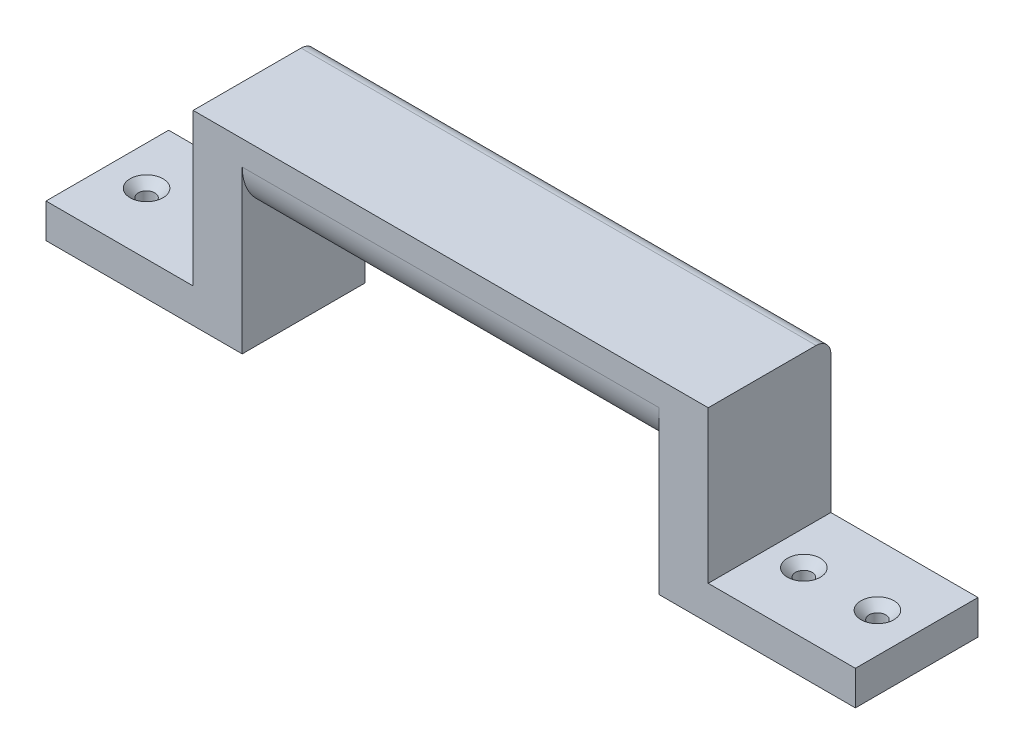
ISO-10303-21;
HEADER;
FILE_DESCRIPTION(('STEP AP214'),'2;1');
FILE_NAME('part.step','',(''),(''),'','','');
FILE_SCHEMA(('AUTOMOTIVE_DESIGN { 1 0 10303 214 1 1 1 1 }'));
ENDSEC;
DATA;
#1=APPLICATION_CONTEXT('core data for automotive mechanical design processes');
#2=APPLICATION_PROTOCOL_DEFINITION('international standard','automotive_design',2000,#1);
#3=PRODUCT_CONTEXT('',#1,'mechanical');
#4=PRODUCT('Part','Part','',(#3));
#5=PRODUCT_RELATED_PRODUCT_CATEGORY('part','',(#4));
#6=PRODUCT_DEFINITION_FORMATION('','',#4);
#7=PRODUCT_DEFINITION_CONTEXT('part definition',#1,'design');
#8=PRODUCT_DEFINITION('design','',#6,#7);
#9=PRODUCT_DEFINITION_SHAPE('','',#8);
#10=(LENGTH_UNIT() NAMED_UNIT(*) SI_UNIT(.MILLI.,.METRE.));
#11=(NAMED_UNIT(*) PLANE_ANGLE_UNIT() SI_UNIT($,.RADIAN.));
#12=(NAMED_UNIT(*) SI_UNIT($,.STERADIAN.) SOLID_ANGLE_UNIT());
#13=UNCERTAINTY_MEASURE_WITH_UNIT(LENGTH_MEASURE(1.E-05),#10,'distance_accuracy_value','');
#14=(GEOMETRIC_REPRESENTATION_CONTEXT(3) GLOBAL_UNCERTAINTY_ASSIGNED_CONTEXT((#13)) GLOBAL_UNIT_ASSIGNED_CONTEXT((#10,
#11,#12)) REPRESENTATION_CONTEXT('',''));
#15=CARTESIAN_POINT('',(0.,0.,0.));
#16=DIRECTION('',(0.,0.,1.));
#17=DIRECTION('',(1.,0.,0.));
#18=AXIS2_PLACEMENT_3D('',#15,#16,#17);
#19=CARTESIAN_POINT('',(-96.5218952923804,1.35730050933787,25.));
#20=DIRECTION('',(-1.,0.,0.));
#21=DIRECTION('',(0.,0.,1.));
#22=AXIS2_PLACEMENT_3D('',#19,#20,#21);
#23=PLANE('',#22);
#24=DIRECTION('',(0.,1.,0.));
#25=VECTOR('',#24,1.);
#26=CARTESIAN_POINT('',(-96.5218952923804,1.35730050933787,25.));
#27=LINE('',#26,#25);
#28=CARTESIAN_POINT('',(-96.5218952923804,-21.6426994906621,25.));
#29=VERTEX_POINT('',#28);
#30=CARTESIAN_POINT('',(-96.5218952923804,11.3573005093379,25.));
#31=VERTEX_POINT('',#30);
#32=EDGE_CURVE('E178',#29,#31,#27,.T.);
#33=ORIENTED_EDGE('',*,*,#32,.F.);
#34=DIRECTION('',(0.,0.,1.));
#35=VECTOR('',#34,1.);
#36=CARTESIAN_POINT('',(-96.5218952923804,-21.6426994906621,0.));
#37=LINE('',#36,#35);
#38=CARTESIAN_POINT('',(-96.5218952923804,-21.6426994906621,0.));
#39=VERTEX_POINT('',#38);
#40=EDGE_CURVE('E237',#39,#29,#37,.T.);
#41=ORIENTED_EDGE('',*,*,#40,.F.);
#42=DIRECTION('',(0.,1.,0.));
#43=VECTOR('',#42,1.);
#44=CARTESIAN_POINT('',(-96.5218952923804,1.35730050933787,0.));
#45=LINE('',#44,#43);
#46=CARTESIAN_POINT('',(-96.5218952923804,11.3573005093379,0.));
#47=VERTEX_POINT('',#46);
#48=EDGE_CURVE('E165',#39,#47,#45,.T.);
#49=ORIENTED_EDGE('',*,*,#48,.T.);
#50=CARTESIAN_POINT('',(-96.5218952923804,11.3573005093379,10.));
#51=DIRECTION('',(-1.,0.,0.));
#52=DIRECTION('',(0.,0.,1.));
#53=AXIS2_PLACEMENT_3D('',#50,#51,#52);
#54=CIRCLE('',#53,10.);
#55=CARTESIAN_POINT('',(-96.5218952923804,1.35730050933787,10.));
#56=VERTEX_POINT('',#55);
#57=EDGE_CURVE('E217',#47,#56,#54,.T.);
#58=ORIENTED_EDGE('',*,*,#57,.T.);
#59=DIRECTION('',(0.,0.,-1.));
#60=VECTOR('',#59,1.);
#61=CARTESIAN_POINT('',(-96.5218952923804,1.35730050933787,25.));
#62=LINE('',#61,#60);
#63=CARTESIAN_POINT('',(-96.5218952923804,1.35730050933787,15.));
#64=VERTEX_POINT('',#63);
#65=EDGE_CURVE('E200',#64,#56,#62,.T.);
#66=ORIENTED_EDGE('',*,*,#65,.F.);
#67=CARTESIAN_POINT('',(-96.5218952923804,11.3573005093379,15.));
#68=DIRECTION('',(-1.,0.,0.));
#69=DIRECTION('',(0.,0.,1.));
#70=AXIS2_PLACEMENT_3D('',#67,#68,#69);
#71=CIRCLE('',#70,10.);
#72=EDGE_CURVE('E221',#64,#31,#71,.T.);
#73=ORIENTED_EDGE('',*,*,#72,.T.);
#74=EDGE_LOOP('',(#33,#41,#49,#58,#66,#73));
#75=FACE_BOUND('',#74,.T.);
#76=ADVANCED_FACE('F33',(#75),#23,.F.);
#77=CARTESIAN_POINT('',(-11.5218952923804,1.35730050933787,25.));
#78=DIRECTION('',(0.,1.,0.));
#79=DIRECTION('',(0.,0.,1.));
#80=AXIS2_PLACEMENT_3D('',#77,#78,#79);
#81=PLANE('',#80);
#82=ORIENTED_EDGE('',*,*,#65,.T.);
#83=DIRECTION('',(1.,0.,0.));
#84=VECTOR('',#83,1.);
#85=CARTESIAN_POINT('',(-11.5218952923804,1.35730050933787,10.));
#86=LINE('',#85,#84);
#87=CARTESIAN_POINT('',(-11.5218952923804,1.35730050933787,10.));
#88=VERTEX_POINT('',#87);
#89=EDGE_CURVE('E205',#56,#88,#86,.T.);
#90=ORIENTED_EDGE('',*,*,#89,.T.);
#91=DIRECTION('',(0.,0.,-1.));
#92=VECTOR('',#91,1.);
#93=CARTESIAN_POINT('',(-11.5218952923804,1.35730050933787,25.));
#94=LINE('',#93,#92);
#95=CARTESIAN_POINT('',(-11.5218952923804,1.35730050933787,15.));
#96=VERTEX_POINT('',#95);
#97=EDGE_CURVE('E197',#96,#88,#94,.T.);
#98=ORIENTED_EDGE('',*,*,#97,.F.);
#99=DIRECTION('',(1.,0.,0.));
#100=VECTOR('',#99,1.);
#101=CARTESIAN_POINT('',(-11.5218952923804,1.35730050933787,15.));
#102=LINE('',#101,#100);
#103=EDGE_CURVE('E203',#96,#64,#102,.F.);
#104=ORIENTED_EDGE('',*,*,#103,.T.);
#105=EDGE_LOOP('',(#82,#90,#98,#104));
#106=FACE_BOUND('',#105,.T.);
#107=ADVANCED_FACE('F298',(#106),#81,.F.);
#108=CARTESIAN_POINT('',(-11.5218952923804,-23.6426994906621,25.));
#109=DIRECTION('',(1.,0.,0.));
#110=DIRECTION('',(0.,0.,-1.));
#111=AXIS2_PLACEMENT_3D('',#108,#109,#110);
#112=PLANE('',#111);
#113=DIRECTION('',(0.,-1.,0.));
#114=VECTOR('',#113,1.);
#115=CARTESIAN_POINT('',(-11.5218952923804,-23.6426994906621,0.));
#116=LINE('',#115,#114);
#117=CARTESIAN_POINT('',(-11.5218952923804,11.3573005093379,0.));
#118=VERTEX_POINT('',#117);
#119=CARTESIAN_POINT('',(-11.5218952923804,-21.6426994906621,0.));
#120=VERTEX_POINT('',#119);
#121=EDGE_CURVE('E161',#118,#120,#116,.T.);
#122=ORIENTED_EDGE('',*,*,#121,.T.);
#123=DIRECTION('',(0.,0.,1.));
#124=VECTOR('',#123,1.);
#125=CARTESIAN_POINT('',(-11.5218952923804,-21.6426994906621,0.));
#126=LINE('',#125,#124);
#127=CARTESIAN_POINT('',(-11.5218952923804,-21.6426994906621,25.));
#128=VERTEX_POINT('',#127);
#129=EDGE_CURVE('E50',#120,#128,#126,.T.);
#130=ORIENTED_EDGE('',*,*,#129,.T.);
#131=DIRECTION('',(0.,-1.,0.));
#132=VECTOR('',#131,1.);
#133=CARTESIAN_POINT('',(-11.5218952923804,-23.6426994906621,25.));
#134=LINE('',#133,#132);
#135=CARTESIAN_POINT('',(-11.5218952923804,11.3573005093379,25.));
#136=VERTEX_POINT('',#135);
#137=EDGE_CURVE('E272',#136,#128,#134,.T.);
#138=ORIENTED_EDGE('',*,*,#137,.F.);
#139=CARTESIAN_POINT('',(-11.5218952923804,11.3573005093379,15.));
#140=DIRECTION('',(1.,0.,0.));
#141=DIRECTION('',(0.,0.,-1.));
#142=AXIS2_PLACEMENT_3D('',#139,#140,#141);
#143=CIRCLE('',#142,10.);
#144=EDGE_CURVE('E219',#136,#96,#143,.T.);
#145=ORIENTED_EDGE('',*,*,#144,.T.);
#146=ORIENTED_EDGE('',*,*,#97,.T.);
#147=CARTESIAN_POINT('',(-11.5218952923804,11.3573005093379,10.));
#148=DIRECTION('',(1.,0.,0.));
#149=DIRECTION('',(0.,0.,-1.));
#150=AXIS2_PLACEMENT_3D('',#147,#148,#149);
#151=CIRCLE('',#150,10.);
#152=EDGE_CURVE('E214',#88,#118,#151,.T.);
#153=ORIENTED_EDGE('',*,*,#152,.T.);
#154=EDGE_LOOP('',(#122,#130,#138,#145,#146,#153));
#155=FACE_BOUND('',#154,.T.);
#156=ADVANCED_FACE('F301',(#155),#112,.F.);
#157=CARTESIAN_POINT('',(28.4781047076196,-14.6426994906621,25.));
#158=DIRECTION('',(-1.,0.,0.));
#159=DIRECTION('',(0.,0.,1.));
#160=AXIS2_PLACEMENT_3D('',#157,#158,#159);
#161=PLANE('',#160);
#162=DIRECTION('',(0.,1.,0.));
#163=VECTOR('',#162,1.);
#164=CARTESIAN_POINT('',(28.4781047076196,-14.6426994906621,25.));
#165=LINE('',#164,#163);
#166=CARTESIAN_POINT('',(28.4781047076196,-21.6426994906621,25.));
#167=VERTEX_POINT('',#166);
#168=CARTESIAN_POINT('',(28.4781047076196,-14.6426994906621,25.));
#169=VERTEX_POINT('',#168);
#170=EDGE_CURVE('E155',#167,#169,#165,.T.);
#171=ORIENTED_EDGE('',*,*,#170,.F.);
#172=DIRECTION('',(0.,0.,1.));
#173=VECTOR('',#172,1.);
#174=CARTESIAN_POINT('',(28.4781047076196,-21.6426994906621,0.));
#175=LINE('',#174,#173);
#176=CARTESIAN_POINT('',(28.4781047076196,-21.6426994906621,0.));
#177=VERTEX_POINT('',#176);
#178=EDGE_CURVE('E142',#177,#167,#175,.T.);
#179=ORIENTED_EDGE('',*,*,#178,.F.);
#180=DIRECTION('',(0.,1.,0.));
#181=VECTOR('',#180,1.);
#182=CARTESIAN_POINT('',(28.4781047076196,-14.6426994906621,0.));
#183=LINE('',#182,#181);
#184=CARTESIAN_POINT('',(28.4781047076196,-14.6426994906621,0.));
#185=VERTEX_POINT('',#184);
#186=EDGE_CURVE('E153',#177,#185,#183,.T.);
#187=ORIENTED_EDGE('',*,*,#186,.T.);
#188=DIRECTION('',(0.,0.,-1.));
#189=VECTOR('',#188,1.);
#190=CARTESIAN_POINT('',(28.4781047076196,-14.6426994906621,25.));
#191=LINE('',#190,#189);
#192=EDGE_CURVE('E195',#169,#185,#191,.T.);
#193=ORIENTED_EDGE('',*,*,#192,.F.);
#194=EDGE_LOOP('',(#171,#179,#187,#193));
#195=FACE_BOUND('',#194,.T.);
#196=ADVANCED_FACE('F151',(#195),#161,.F.);
#197=CARTESIAN_POINT('',(-1.52189529238038,-14.6426994906621,25.));
#198=DIRECTION('',(0.,-1.,0.));
#199=DIRECTION('',(0.,0.,-1.));
#200=AXIS2_PLACEMENT_3D('',#197,#198,#199);
#201=PLANE('',#200);
#202=CARTESIAN_POINT('',(20.4781047076196,-14.6426994906621,12.5));
#203=DIRECTION('',(0.,1.,0.));
#204=DIRECTION('',(0.,0.,1.));
#205=AXIS2_PLACEMENT_3D('',#202,#203,#204);
#206=CIRCLE('',#205,3.36);
#207=CARTESIAN_POINT('',(20.4781047076196,-14.6426994906621,15.86));
#208=VERTEX_POINT('',#207);
#209=EDGE_CURVE('E259',#208,#208,#206,.T.);
#210=ORIENTED_EDGE('',*,*,#209,.F.);
#211=EDGE_LOOP('',(#210));
#212=FACE_BOUND('',#211,.T.);
#213=CARTESIAN_POINT('',(5.47810470761964,-14.6426994906621,12.5));
#214=DIRECTION('',(0.,1.,0.));
#215=DIRECTION('',(0.,0.,1.));
#216=AXIS2_PLACEMENT_3D('',#213,#214,#215);
#217=CIRCLE('',#216,3.36);
#218=CARTESIAN_POINT('',(5.47810470761964,-14.6426994906621,15.86));
#219=VERTEX_POINT('',#218);
#220=EDGE_CURVE('E265',#219,#219,#217,.T.);
#221=ORIENTED_EDGE('',*,*,#220,.F.);
#222=EDGE_LOOP('',(#221));
#223=FACE_BOUND('',#222,.T.);
#224=DIRECTION('',(-1.,0.,0.));
#225=VECTOR('',#224,1.);
#226=CARTESIAN_POINT('',(-1.52189529238038,-14.6426994906621,0.));
#227=LINE('',#226,#225);
#228=CARTESIAN_POINT('',(-1.52189529238038,-14.6426994906621,0.));
#229=VERTEX_POINT('',#228);
#230=EDGE_CURVE('E160',#185,#229,#227,.T.);
#231=ORIENTED_EDGE('',*,*,#230,.T.);
#232=DIRECTION('',(0.,0.,-1.));
#233=VECTOR('',#232,1.);
#234=CARTESIAN_POINT('',(-1.52189529238038,-14.6426994906621,25.));
#235=LINE('',#234,#233);
#236=CARTESIAN_POINT('',(-1.52189529238038,-14.6426994906621,25.));
#237=VERTEX_POINT('',#236);
#238=EDGE_CURVE('E192',#237,#229,#235,.T.);
#239=ORIENTED_EDGE('',*,*,#238,.F.);
#240=DIRECTION('',(-1.,0.,0.));
#241=VECTOR('',#240,1.);
#242=CARTESIAN_POINT('',(-1.52189529238038,-14.6426994906621,25.));
#243=LINE('',#242,#241);
#244=EDGE_CURVE('E276',#169,#237,#243,.T.);
#245=ORIENTED_EDGE('',*,*,#244,.F.);
#246=ORIENTED_EDGE('',*,*,#192,.T.);
#247=EDGE_LOOP('',(#231,#239,#245,#246));
#248=FACE_BOUND('',#247,.T.);
#249=ADVANCED_FACE('F321',(#212,#223,#248),#201,.F.);
#250=CARTESIAN_POINT('',(-1.52189529238038,16.3573005093379,25.));
#251=DIRECTION('',(-1.,0.,0.));
#252=DIRECTION('',(0.,0.,1.));
#253=AXIS2_PLACEMENT_3D('',#250,#251,#252);
#254=PLANE('',#253);
#255=DIRECTION('',(0.,1.,0.));
#256=VECTOR('',#255,1.);
#257=CARTESIAN_POINT('',(-1.52189529238038,16.3573005093379,0.));
#258=LINE('',#257,#256);
#259=CARTESIAN_POINT('',(-1.52189529238038,13.3573005093379,0.));
#260=VERTEX_POINT('',#259);
#261=EDGE_CURVE('E163',#229,#260,#258,.T.);
#262=ORIENTED_EDGE('',*,*,#261,.T.);
#263=CARTESIAN_POINT('',(-1.52189529238038,13.3573005093379,3.));
#264=DIRECTION('',(-1.,0.,0.));
#265=DIRECTION('',(0.,0.,1.));
#266=AXIS2_PLACEMENT_3D('',#263,#264,#265);
#267=CIRCLE('',#266,3.);
#268=CARTESIAN_POINT('',(-1.52189529238038,16.3573005093379,3.));
#269=VERTEX_POINT('',#268);
#270=EDGE_CURVE('E11',#260,#269,#267,.F.);
#271=ORIENTED_EDGE('',*,*,#270,.T.);
#272=DIRECTION('',(0.,0.,-1.));
#273=VECTOR('',#272,1.);
#274=CARTESIAN_POINT('',(-1.52189529238038,16.3573005093379,25.));
#275=LINE('',#274,#273);
#276=CARTESIAN_POINT('',(-1.52189529238038,16.3573005093379,25.));
#277=VERTEX_POINT('',#276);
#278=EDGE_CURVE('E189',#277,#269,#275,.T.);
#279=ORIENTED_EDGE('',*,*,#278,.F.);
#280=DIRECTION('',(0.,1.,0.));
#281=VECTOR('',#280,1.);
#282=CARTESIAN_POINT('',(-1.52189529238038,16.3573005093379,25.));
#283=LINE('',#282,#281);
#284=EDGE_CURVE('E278',#237,#277,#283,.T.);
#285=ORIENTED_EDGE('',*,*,#284,.F.);
#286=ORIENTED_EDGE('',*,*,#238,.T.);
#287=EDGE_LOOP('',(#262,#271,#279,#285,#286));
#288=FACE_BOUND('',#287,.T.);
#289=ADVANCED_FACE('F325',(#288),#254,.F.);
#290=CARTESIAN_POINT('',(-106.52189529238,16.3573005093379,25.));
#291=DIRECTION('',(0.,-1.,0.));
#292=DIRECTION('',(0.,0.,-1.));
#293=AXIS2_PLACEMENT_3D('',#290,#291,#292);
#294=PLANE('',#293);
#295=ORIENTED_EDGE('',*,*,#278,.T.);
#296=DIRECTION('',(-1.,0.,0.));
#297=VECTOR('',#296,1.);
#298=CARTESIAN_POINT('',(-106.52189529238,16.3573005093379,3.));
#299=LINE('',#298,#297);
#300=CARTESIAN_POINT('',(-106.52189529238,16.3573005093379,3.));
#301=VERTEX_POINT('',#300);
#302=EDGE_CURVE('E224',#269,#301,#299,.T.);
#303=ORIENTED_EDGE('',*,*,#302,.T.);
#304=DIRECTION('',(0.,0.,-1.));
#305=VECTOR('',#304,1.);
#306=CARTESIAN_POINT('',(-106.52189529238,16.3573005093379,25.));
#307=LINE('',#306,#305);
#308=CARTESIAN_POINT('',(-106.52189529238,16.3573005093379,25.));
#309=VERTEX_POINT('',#308);
#310=EDGE_CURVE('E186',#309,#301,#307,.T.);
#311=ORIENTED_EDGE('',*,*,#310,.F.);
#312=DIRECTION('',(-1.,0.,0.));
#313=VECTOR('',#312,1.);
#314=CARTESIAN_POINT('',(-106.52189529238,16.3573005093379,25.));
#315=LINE('',#314,#313);
#316=EDGE_CURVE('E280',#277,#309,#315,.T.);
#317=ORIENTED_EDGE('',*,*,#316,.F.);
#318=EDGE_LOOP('',(#295,#303,#311,#317));
#319=FACE_BOUND('',#318,.T.);
#320=ADVANCED_FACE('F331',(#319),#294,.F.);
#321=CARTESIAN_POINT('',(-106.52189529238,-14.6426994906621,25.));
#322=DIRECTION('',(1.,0.,0.));
#323=DIRECTION('',(0.,0.,-1.));
#324=AXIS2_PLACEMENT_3D('',#321,#322,#323);
#325=PLANE('',#324);
#326=ORIENTED_EDGE('',*,*,#310,.T.);
#327=CARTESIAN_POINT('',(-106.52189529238,13.3573005093379,3.));
#328=DIRECTION('',(1.,0.,0.));
#329=DIRECTION('',(0.,0.,-1.));
#330=AXIS2_PLACEMENT_3D('',#327,#328,#329);
#331=CIRCLE('',#330,3.);
#332=CARTESIAN_POINT('',(-106.52189529238,13.3573005093379,0.));
#333=VERTEX_POINT('',#332);
#334=EDGE_CURVE('E227',#301,#333,#331,.F.);
#335=ORIENTED_EDGE('',*,*,#334,.T.);
#336=DIRECTION('',(0.,-1.,0.));
#337=VECTOR('',#336,1.);
#338=CARTESIAN_POINT('',(-106.52189529238,-14.6426994906621,0.));
#339=LINE('',#338,#337);
#340=CARTESIAN_POINT('',(-106.52189529238,-14.6426994906621,0.));
#341=VERTEX_POINT('',#340);
#342=EDGE_CURVE('E171',#333,#341,#339,.T.);
#343=ORIENTED_EDGE('',*,*,#342,.T.);
#344=DIRECTION('',(0.,0.,-1.));
#345=VECTOR('',#344,1.);
#346=CARTESIAN_POINT('',(-106.52189529238,-14.6426994906621,25.));
#347=LINE('',#346,#345);
#348=CARTESIAN_POINT('',(-106.52189529238,-14.6426994906621,25.));
#349=VERTEX_POINT('',#348);
#350=EDGE_CURVE('E182',#349,#341,#347,.T.);
#351=ORIENTED_EDGE('',*,*,#350,.F.);
#352=DIRECTION('',(0.,-1.,0.));
#353=VECTOR('',#352,1.);
#354=CARTESIAN_POINT('',(-106.52189529238,-14.6426994906621,25.));
#355=LINE('',#354,#353);
#356=EDGE_CURVE('E282',#309,#349,#355,.T.);
#357=ORIENTED_EDGE('',*,*,#356,.F.);
#358=EDGE_LOOP('',(#326,#335,#343,#351,#357));
#359=FACE_BOUND('',#358,.T.);
#360=ADVANCED_FACE('F334',(#359),#325,.F.);
#361=CARTESIAN_POINT('',(-136.52189529238,-14.6426994906621,25.));
#362=DIRECTION('',(0.,-1.,0.));
#363=DIRECTION('',(0.,0.,-1.));
#364=AXIS2_PLACEMENT_3D('',#361,#362,#363);
#365=PLANE('',#364);
#366=CARTESIAN_POINT('',(-128.52189529238,-14.6426994906621,12.5));
#367=DIRECTION('',(0.,1.,0.));
#368=DIRECTION('',(0.,0.,1.));
#369=AXIS2_PLACEMENT_3D('',#366,#367,#368);
#370=CIRCLE('',#369,3.36);
#371=CARTESIAN_POINT('',(-128.52189529238,-14.6426994906621,15.86));
#372=VERTEX_POINT('',#371);
#373=EDGE_CURVE('E235',#372,#372,#370,.T.);
#374=ORIENTED_EDGE('',*,*,#373,.F.);
#375=EDGE_LOOP('',(#374));
#376=FACE_BOUND('',#375,.T.);
#377=CARTESIAN_POINT('',(-113.52189529238,-14.6426994906621,12.5));
#378=DIRECTION('',(0.,1.,0.));
#379=DIRECTION('',(0.,0.,1.));
#380=AXIS2_PLACEMENT_3D('',#377,#378,#379);
#381=CIRCLE('',#380,3.36);
#382=CARTESIAN_POINT('',(-113.52189529238,-14.6426994906621,15.86));
#383=VERTEX_POINT('',#382);
#384=EDGE_CURVE('E253',#383,#383,#381,.T.);
#385=ORIENTED_EDGE('',*,*,#384,.F.);
#386=EDGE_LOOP('',(#385));
#387=FACE_BOUND('',#386,.T.);
#388=DIRECTION('',(-1.,0.,0.));
#389=VECTOR('',#388,1.);
#390=CARTESIAN_POINT('',(-136.52189529238,-14.6426994906621,0.));
#391=LINE('',#390,#389);
#392=CARTESIAN_POINT('',(-136.52189529238,-14.6426994906621,0.));
#393=VERTEX_POINT('',#392);
#394=EDGE_CURVE('E173',#341,#393,#391,.T.);
#395=ORIENTED_EDGE('',*,*,#394,.T.);
#396=DIRECTION('',(0.,0.,-1.));
#397=VECTOR('',#396,1.);
#398=CARTESIAN_POINT('',(-136.52189529238,-14.6426994906621,25.));
#399=LINE('',#398,#397);
#400=CARTESIAN_POINT('',(-136.52189529238,-14.6426994906621,25.));
#401=VERTEX_POINT('',#400);
#402=EDGE_CURVE('E179',#401,#393,#399,.T.);
#403=ORIENTED_EDGE('',*,*,#402,.F.);
#404=DIRECTION('',(-1.,0.,0.));
#405=VECTOR('',#404,1.);
#406=CARTESIAN_POINT('',(-136.52189529238,-14.6426994906621,25.));
#407=LINE('',#406,#405);
#408=EDGE_CURVE('E284',#349,#401,#407,.T.);
#409=ORIENTED_EDGE('',*,*,#408,.F.);
#410=ORIENTED_EDGE('',*,*,#350,.T.);
#411=EDGE_LOOP('',(#395,#403,#409,#410));
#412=FACE_BOUND('',#411,.T.);
#413=ADVANCED_FACE('F340',(#376,#387,#412),#365,.F.);
#414=CARTESIAN_POINT('',(-136.52189529238,-23.6426994906621,25.));
#415=DIRECTION('',(1.,0.,0.));
#416=DIRECTION('',(0.,0.,-1.));
#417=AXIS2_PLACEMENT_3D('',#414,#415,#416);
#418=PLANE('',#417);
#419=DIRECTION('',(0.,-1.,0.));
#420=VECTOR('',#419,1.);
#421=CARTESIAN_POINT('',(-136.52189529238,-23.6426994906621,0.));
#422=LINE('',#421,#420);
#423=CARTESIAN_POINT('',(-136.52189529238,-21.6426994906621,0.));
#424=VERTEX_POINT('',#423);
#425=EDGE_CURVE('E175',#393,#424,#422,.T.);
#426=ORIENTED_EDGE('',*,*,#425,.T.);
#427=DIRECTION('',(0.,0.,1.));
#428=VECTOR('',#427,1.);
#429=CARTESIAN_POINT('',(-136.52189529238,-21.6426994906621,0.));
#430=LINE('',#429,#428);
#431=CARTESIAN_POINT('',(-136.52189529238,-21.6426994906621,25.));
#432=VERTEX_POINT('',#431);
#433=EDGE_CURVE('E58',#424,#432,#430,.T.);
#434=ORIENTED_EDGE('',*,*,#433,.T.);
#435=DIRECTION('',(0.,-1.,0.));
#436=VECTOR('',#435,1.);
#437=CARTESIAN_POINT('',(-136.52189529238,-23.6426994906621,25.));
#438=LINE('',#437,#436);
#439=EDGE_CURVE('E183',#401,#432,#438,.T.);
#440=ORIENTED_EDGE('',*,*,#439,.F.);
#441=ORIENTED_EDGE('',*,*,#402,.T.);
#442=EDGE_LOOP('',(#426,#434,#440,#441));
#443=FACE_BOUND('',#442,.T.);
#444=ADVANCED_FACE('F342',(#443),#418,.F.);
#445=CARTESIAN_POINT('',(0.,0.,25.));
#446=DIRECTION('',(0.,0.,-1.));
#447=DIRECTION('',(-1.,0.,0.));
#448=AXIS2_PLACEMENT_3D('',#445,#446,#447);
#449=PLANE('',#448);
#450=ORIENTED_EDGE('',*,*,#137,.T.);
#451=DIRECTION('',(-1.,0.,0.));
#452=VECTOR('',#451,1.);
#453=CARTESIAN_POINT('',(28.4781047076196,-21.6426994906621,25.));
#454=LINE('',#453,#452);
#455=EDGE_CURVE('E147',#167,#128,#454,.T.);
#456=ORIENTED_EDGE('',*,*,#455,.F.);
#457=ORIENTED_EDGE('',*,*,#170,.T.);
#458=ORIENTED_EDGE('',*,*,#244,.T.);
#459=ORIENTED_EDGE('',*,*,#284,.T.);
#460=ORIENTED_EDGE('',*,*,#316,.T.);
#461=ORIENTED_EDGE('',*,*,#356,.T.);
#462=ORIENTED_EDGE('',*,*,#408,.T.);
#463=ORIENTED_EDGE('',*,*,#439,.T.);
#464=DIRECTION('',(-1.,0.,0.));
#465=VECTOR('',#464,1.);
#466=CARTESIAN_POINT('',(-136.52189529238,-21.6426994906621,25.));
#467=LINE('',#466,#465);
#468=EDGE_CURVE('E245',#29,#432,#467,.T.);
#469=ORIENTED_EDGE('',*,*,#468,.F.);
#470=ORIENTED_EDGE('',*,*,#32,.T.);
#471=DIRECTION('',(1.,0.,0.));
#472=VECTOR('',#471,1.);
#473=CARTESIAN_POINT('',(0.,11.3573005093379,25.));
#474=LINE('',#473,#472);
#475=EDGE_CURVE('E211',#31,#136,#474,.T.);
#476=ORIENTED_EDGE('',*,*,#475,.T.);
#477=EDGE_LOOP('',(#450,#456,#457,#458,#459,#460,#461,#462,#463,#469,#470,#476));
#478=FACE_BOUND('',#477,.T.);
#479=ADVANCED_FACE('F308',(#478),#449,.F.);
#480=CARTESIAN_POINT('',(0.,0.,0.));
#481=DIRECTION('',(0.,0.,-1.));
#482=DIRECTION('',(-1.,0.,0.));
#483=AXIS2_PLACEMENT_3D('',#480,#481,#482);
#484=PLANE('',#483);
#485=DIRECTION('',(-1.,0.,0.));
#486=VECTOR('',#485,1.);
#487=CARTESIAN_POINT('',(28.4781047076196,-21.6426994906621,0.));
#488=LINE('',#487,#486);
#489=EDGE_CURVE('E138',#177,#120,#488,.T.);
#490=ORIENTED_EDGE('',*,*,#489,.T.);
#491=ORIENTED_EDGE('',*,*,#121,.F.);
#492=DIRECTION('',(1.,0.,0.));
#493=VECTOR('',#492,1.);
#494=CARTESIAN_POINT('',(-96.5218952923804,11.3573005093379,0.));
#495=LINE('',#494,#493);
#496=EDGE_CURVE('E208',#118,#47,#495,.F.);
#497=ORIENTED_EDGE('',*,*,#496,.T.);
#498=ORIENTED_EDGE('',*,*,#48,.F.);
#499=DIRECTION('',(-1.,0.,0.));
#500=VECTOR('',#499,1.);
#501=CARTESIAN_POINT('',(-136.52189529238,-21.6426994906621,0.));
#502=LINE('',#501,#500);
#503=EDGE_CURVE('E242',#39,#424,#502,.T.);
#504=ORIENTED_EDGE('',*,*,#503,.T.);
#505=ORIENTED_EDGE('',*,*,#425,.F.);
#506=ORIENTED_EDGE('',*,*,#394,.F.);
#507=ORIENTED_EDGE('',*,*,#342,.F.);
#508=DIRECTION('',(-1.,0.,0.));
#509=VECTOR('',#508,1.);
#510=CARTESIAN_POINT('',(-1.52189529238038,13.3573005093379,0.));
#511=LINE('',#510,#509);
#512=EDGE_CURVE('E42',#333,#260,#511,.F.);
#513=ORIENTED_EDGE('',*,*,#512,.T.);
#514=ORIENTED_EDGE('',*,*,#261,.F.);
#515=ORIENTED_EDGE('',*,*,#230,.F.);
#516=ORIENTED_EDGE('',*,*,#186,.F.);
#517=EDGE_LOOP('',(#490,#491,#497,#498,#504,#505,#506,#507,#513,#514,#515,#516));
#518=FACE_BOUND('',#517,.T.);
#519=ADVANCED_FACE('F158',(#518),#484,.T.);
#520=CARTESIAN_POINT('',(-11.5218952923804,11.3573005093379,10.));
#521=DIRECTION('',(-1.,0.,0.));
#522=DIRECTION('',(0.,0.,1.));
#523=AXIS2_PLACEMENT_3D('',#520,#521,#522);
#524=CYLINDRICAL_SURFACE('',#523,10.);
#525=ORIENTED_EDGE('',*,*,#57,.F.);
#526=ORIENTED_EDGE('',*,*,#496,.F.);
#527=ORIENTED_EDGE('',*,*,#152,.F.);
#528=ORIENTED_EDGE('',*,*,#89,.F.);
#529=EDGE_LOOP('',(#525,#526,#527,#528));
#530=FACE_BOUND('',#529,.T.);
#531=ADVANCED_FACE('F295',(#530),#524,.T.);
#532=CARTESIAN_POINT('',(0.,11.3573005093379,15.));
#533=DIRECTION('',(1.,0.,0.));
#534=DIRECTION('',(0.,0.,-1.));
#535=AXIS2_PLACEMENT_3D('',#532,#533,#534);
#536=CYLINDRICAL_SURFACE('',#535,10.);
#537=ORIENTED_EDGE('',*,*,#72,.F.);
#538=ORIENTED_EDGE('',*,*,#103,.F.);
#539=ORIENTED_EDGE('',*,*,#144,.F.);
#540=ORIENTED_EDGE('',*,*,#475,.F.);
#541=EDGE_LOOP('',(#537,#538,#539,#540));
#542=FACE_BOUND('',#541,.T.);
#543=ADVANCED_FACE('F306',(#542),#536,.T.);
#544=CARTESIAN_POINT('',(-106.52189529238,13.3573005093379,3.));
#545=DIRECTION('',(1.,0.,0.));
#546=DIRECTION('',(0.,0.,-1.));
#547=AXIS2_PLACEMENT_3D('',#544,#545,#546);
#548=CYLINDRICAL_SURFACE('',#547,3.);
#549=ORIENTED_EDGE('',*,*,#270,.F.);
#550=ORIENTED_EDGE('',*,*,#512,.F.);
#551=ORIENTED_EDGE('',*,*,#334,.F.);
#552=ORIENTED_EDGE('',*,*,#302,.F.);
#553=EDGE_LOOP('',(#549,#550,#551,#552));
#554=FACE_BOUND('',#553,.T.);
#555=ADVANCED_FACE('F35',(#554),#548,.T.);
#556=CARTESIAN_POINT('',(5.47810470761964,-14.6426994906621,12.5));
#557=DIRECTION('',(0.,1.,0.));
#558=DIRECTION('',(0.,0.,1.));
#559=AXIS2_PLACEMENT_3D('',#556,#557,#558);
#560=CYLINDRICAL_SURFACE('',#559,1.7);
#561=CARTESIAN_POINT('',(5.47810470761964,-21.6426994906621,12.5));
#562=DIRECTION('',(0.,1.,0.));
#563=DIRECTION('',(0.,0.,1.));
#564=AXIS2_PLACEMENT_3D('',#561,#562,#563);
#565=CIRCLE('',#564,1.7);
#566=CARTESIAN_POINT('',(5.47810470761964,-21.6426994906621,14.2));
#567=VERTEX_POINT('',#566);
#568=EDGE_CURVE('E310',#567,#567,#565,.F.);
#569=ORIENTED_EDGE('',*,*,#568,.T.);
#570=EDGE_LOOP('',(#569));
#571=FACE_BOUND('',#570,.T.);
#572=CARTESIAN_POINT('',(5.47810470761964,-16.3026994906621,12.5));
#573=DIRECTION('',(0.,1.,0.));
#574=DIRECTION('',(0.,0.,1.));
#575=AXIS2_PLACEMENT_3D('',#572,#573,#574);
#576=CIRCLE('',#575,1.7);
#577=CARTESIAN_POINT('',(5.47810470761964,-16.3026994906621,14.2));
#578=VERTEX_POINT('',#577);
#579=EDGE_CURVE('E268',#578,#578,#576,.T.);
#580=ORIENTED_EDGE('',*,*,#579,.T.);
#581=EDGE_LOOP('',(#580));
#582=FACE_BOUND('',#581,.T.);
#583=ADVANCED_FACE('F366',(#571,#582),#560,.F.);
#584=CARTESIAN_POINT('',(5.47810470761964,-14.6426994906621,12.5));
#585=DIRECTION('',(0.,1.,0.));
#586=DIRECTION('',(0.,0.,1.));
#587=AXIS2_PLACEMENT_3D('',#584,#585,#586);
#588=CONICAL_SURFACE('',#587,3.36,0.785398163397449);
#589=ORIENTED_EDGE('',*,*,#579,.F.);
#590=EDGE_LOOP('',(#589));
#591=FACE_BOUND('',#590,.T.);
#592=ORIENTED_EDGE('',*,*,#220,.T.);
#593=EDGE_LOOP('',(#592));
#594=FACE_BOUND('',#593,.T.);
#595=ADVANCED_FACE('F371',(#591,#594),#588,.F.);
#596=CARTESIAN_POINT('',(20.4781047076196,-14.6426994906621,12.5));
#597=DIRECTION('',(0.,1.,0.));
#598=DIRECTION('',(0.,0.,1.));
#599=AXIS2_PLACEMENT_3D('',#596,#597,#598);
#600=CYLINDRICAL_SURFACE('',#599,1.7);
#601=CARTESIAN_POINT('',(20.4781047076196,-21.6426994906621,12.5));
#602=DIRECTION('',(0.,1.,0.));
#603=DIRECTION('',(0.,0.,1.));
#604=AXIS2_PLACEMENT_3D('',#601,#602,#603);
#605=CIRCLE('',#604,1.7);
#606=CARTESIAN_POINT('',(20.4781047076196,-21.6426994906621,14.2));
#607=VERTEX_POINT('',#606);
#608=EDGE_CURVE('E37',#607,#607,#605,.F.);
#609=ORIENTED_EDGE('',*,*,#608,.T.);
#610=EDGE_LOOP('',(#609));
#611=FACE_BOUND('',#610,.T.);
#612=CARTESIAN_POINT('',(20.4781047076196,-16.3026994906621,12.5));
#613=DIRECTION('',(0.,1.,0.));
#614=DIRECTION('',(0.,0.,1.));
#615=AXIS2_PLACEMENT_3D('',#612,#613,#614);
#616=CIRCLE('',#615,1.7);
#617=CARTESIAN_POINT('',(20.4781047076196,-16.3026994906621,14.2));
#618=VERTEX_POINT('',#617);
#619=EDGE_CURVE('E262',#618,#618,#616,.T.);
#620=ORIENTED_EDGE('',*,*,#619,.T.);
#621=EDGE_LOOP('',(#620));
#622=FACE_BOUND('',#621,.T.);
#623=ADVANCED_FACE('F405',(#611,#622),#600,.F.);
#624=CARTESIAN_POINT('',(20.4781047076196,-14.6426994906621,12.5));
#625=DIRECTION('',(0.,1.,0.));
#626=DIRECTION('',(0.,0.,1.));
#627=AXIS2_PLACEMENT_3D('',#624,#625,#626);
#628=CONICAL_SURFACE('',#627,3.36,0.785398163397449);
#629=ORIENTED_EDGE('',*,*,#619,.F.);
#630=EDGE_LOOP('',(#629));
#631=FACE_BOUND('',#630,.T.);
#632=ORIENTED_EDGE('',*,*,#209,.T.);
#633=EDGE_LOOP('',(#632));
#634=FACE_BOUND('',#633,.T.);
#635=ADVANCED_FACE('F387',(#631,#634),#628,.F.);
#636=CARTESIAN_POINT('',(-113.52189529238,-14.6426994906621,12.5));
#637=DIRECTION('',(0.,1.,0.));
#638=DIRECTION('',(0.,0.,1.));
#639=AXIS2_PLACEMENT_3D('',#636,#637,#638);
#640=CYLINDRICAL_SURFACE('',#639,1.69999999999999);
#641=CARTESIAN_POINT('',(-113.52189529238,-21.6426994906621,12.5));
#642=DIRECTION('',(0.,1.,0.));
#643=DIRECTION('',(0.,0.,1.));
#644=AXIS2_PLACEMENT_3D('',#641,#642,#643);
#645=CIRCLE('',#644,1.69999999999999);
#646=CARTESIAN_POINT('',(-113.52189529238,-21.6426994906621,14.2));
#647=VERTEX_POINT('',#646);
#648=EDGE_CURVE('E231',#647,#647,#645,.F.);
#649=ORIENTED_EDGE('',*,*,#648,.T.);
#650=EDGE_LOOP('',(#649));
#651=FACE_BOUND('',#650,.T.);
#652=CARTESIAN_POINT('',(-113.52189529238,-16.3026994906621,12.5));
#653=DIRECTION('',(0.,1.,0.));
#654=DIRECTION('',(0.,0.,1.));
#655=AXIS2_PLACEMENT_3D('',#652,#653,#654);
#656=CIRCLE('',#655,1.69999999999999);
#657=CARTESIAN_POINT('',(-113.52189529238,-16.3026994906621,14.2));
#658=VERTEX_POINT('',#657);
#659=EDGE_CURVE('E256',#658,#658,#656,.T.);
#660=ORIENTED_EDGE('',*,*,#659,.T.);
#661=EDGE_LOOP('',(#660));
#662=FACE_BOUND('',#661,.T.);
#663=ADVANCED_FACE('F383',(#651,#662),#640,.F.);
#664=CARTESIAN_POINT('',(-113.52189529238,-14.6426994906621,12.5));
#665=DIRECTION('',(0.,1.,0.));
#666=DIRECTION('',(0.,0.,1.));
#667=AXIS2_PLACEMENT_3D('',#664,#665,#666);
#668=CONICAL_SURFACE('',#667,3.36,0.785398163397451);
#669=ORIENTED_EDGE('',*,*,#659,.F.);
#670=EDGE_LOOP('',(#669));
#671=FACE_BOUND('',#670,.T.);
#672=ORIENTED_EDGE('',*,*,#384,.T.);
#673=EDGE_LOOP('',(#672));
#674=FACE_BOUND('',#673,.T.);
#675=ADVANCED_FACE('F386',(#671,#674),#668,.F.);
#676=CARTESIAN_POINT('',(-128.52189529238,-14.6426994906621,12.5));
#677=DIRECTION('',(0.,1.,0.));
#678=DIRECTION('',(0.,0.,1.));
#679=AXIS2_PLACEMENT_3D('',#676,#677,#678);
#680=CYLINDRICAL_SURFACE('',#679,1.70000000000001);
#681=CARTESIAN_POINT('',(-128.52189529238,-21.6426994906621,12.5));
#682=DIRECTION('',(0.,1.,0.));
#683=DIRECTION('',(0.,0.,1.));
#684=AXIS2_PLACEMENT_3D('',#681,#682,#683);
#685=CIRCLE('',#684,1.70000000000001);
#686=CARTESIAN_POINT('',(-128.52189529238,-21.6426994906621,14.2));
#687=VERTEX_POINT('',#686);
#688=EDGE_CURVE('E229',#687,#687,#685,.F.);
#689=ORIENTED_EDGE('',*,*,#688,.T.);
#690=EDGE_LOOP('',(#689));
#691=FACE_BOUND('',#690,.T.);
#692=CARTESIAN_POINT('',(-128.52189529238,-16.3026994906621,12.5));
#693=DIRECTION('',(0.,1.,0.));
#694=DIRECTION('',(0.,0.,1.));
#695=AXIS2_PLACEMENT_3D('',#692,#693,#694);
#696=CIRCLE('',#695,1.70000000000001);
#697=CARTESIAN_POINT('',(-128.52189529238,-16.3026994906621,14.2));
#698=VERTEX_POINT('',#697);
#699=EDGE_CURVE('E250',#698,#698,#696,.T.);
#700=ORIENTED_EDGE('',*,*,#699,.T.);
#701=EDGE_LOOP('',(#700));
#702=FACE_BOUND('',#701,.T.);
#703=ADVANCED_FACE('F393',(#691,#702),#680,.F.);
#704=CARTESIAN_POINT('',(-128.52189529238,-14.6426994906621,12.5));
#705=DIRECTION('',(0.,1.,0.));
#706=DIRECTION('',(0.,0.,1.));
#707=AXIS2_PLACEMENT_3D('',#704,#705,#706);
#708=CONICAL_SURFACE('',#707,3.36,0.785398163397447);
#709=ORIENTED_EDGE('',*,*,#699,.F.);
#710=EDGE_LOOP('',(#709));
#711=FACE_BOUND('',#710,.T.);
#712=ORIENTED_EDGE('',*,*,#373,.T.);
#713=EDGE_LOOP('',(#712));
#714=FACE_BOUND('',#713,.T.);
#715=ADVANCED_FACE('F378',(#711,#714),#708,.F.);
#716=CARTESIAN_POINT('',(-136.52189529238,-21.6426994906621,0.));
#717=DIRECTION('',(0.,1.,0.));
#718=DIRECTION('',(0.,0.,1.));
#719=AXIS2_PLACEMENT_3D('',#716,#717,#718);
#720=PLANE('',#719);
#721=ORIENTED_EDGE('',*,*,#688,.F.);
#722=EDGE_LOOP('',(#721));
#723=FACE_BOUND('',#722,.T.);
#724=ORIENTED_EDGE('',*,*,#468,.T.);
#725=ORIENTED_EDGE('',*,*,#433,.F.);
#726=ORIENTED_EDGE('',*,*,#503,.F.);
#727=ORIENTED_EDGE('',*,*,#40,.T.);
#728=EDGE_LOOP('',(#724,#725,#726,#727));
#729=FACE_BOUND('',#728,.T.);
#730=ORIENTED_EDGE('',*,*,#648,.F.);
#731=EDGE_LOOP('',(#730));
#732=FACE_BOUND('',#731,.T.);
#733=ADVANCED_FACE('F375',(#723,#729,#732),#720,.F.);
#734=CARTESIAN_POINT('',(28.4781047076196,-21.6426994906621,0.));
#735=DIRECTION('',(0.,1.,0.));
#736=DIRECTION('',(0.,0.,1.));
#737=AXIS2_PLACEMENT_3D('',#734,#735,#736);
#738=PLANE('',#737);
#739=ORIENTED_EDGE('',*,*,#608,.F.);
#740=EDGE_LOOP('',(#739));
#741=FACE_BOUND('',#740,.T.);
#742=ORIENTED_EDGE('',*,*,#455,.T.);
#743=ORIENTED_EDGE('',*,*,#129,.F.);
#744=ORIENTED_EDGE('',*,*,#489,.F.);
#745=ORIENTED_EDGE('',*,*,#178,.T.);
#746=EDGE_LOOP('',(#742,#743,#744,#745));
#747=FACE_BOUND('',#746,.T.);
#748=ORIENTED_EDGE('',*,*,#568,.F.);
#749=EDGE_LOOP('',(#748));
#750=FACE_BOUND('',#749,.T.);
#751=ADVANCED_FACE('F140',(#741,#747,#750),#738,.F.);
#752=CLOSED_SHELL('',(#76,#107,#156,#196,#249,#289,#320,#360,#413,#444,#479,#519,#531,#543,#555,
#583,#595,#623,#635,#663,#675,#703,#715,#733,#751));
#753=MANIFOLD_SOLID_BREP('B2',#752);
#754=ADVANCED_BREP_SHAPE_REPRESENTATION('',(#18,#753),#14);
#755=SHAPE_DEFINITION_REPRESENTATION(#9,#754);
ENDSEC;
END-ISO-10303-21;
